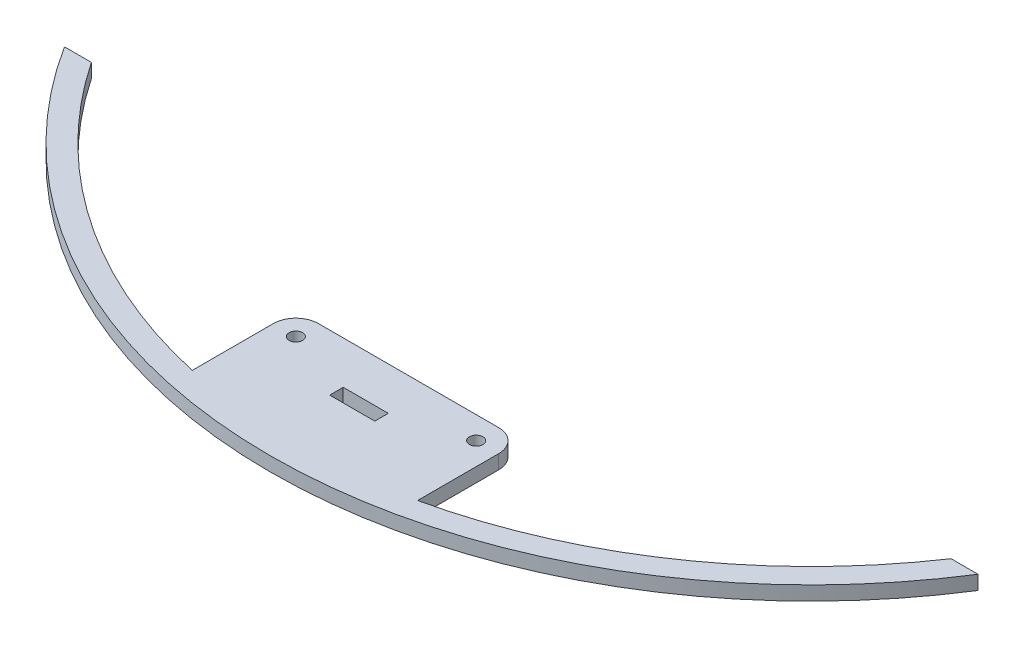
ISO-10303-21;
HEADER;
FILE_DESCRIPTION(('STEP AP214'),'2;1');
FILE_NAME('part.step','',(''),(''),'','','');
FILE_SCHEMA(('AUTOMOTIVE_DESIGN { 1 0 10303 214 1 1 1 1 }'));
ENDSEC;
DATA;
#1=APPLICATION_CONTEXT('core data for automotive mechanical design processes');
#2=APPLICATION_PROTOCOL_DEFINITION('international standard','automotive_design',2000,#1);
#3=PRODUCT_CONTEXT('',#1,'mechanical');
#4=PRODUCT('Part','Part','',(#3));
#5=PRODUCT_RELATED_PRODUCT_CATEGORY('part','',(#4));
#6=PRODUCT_DEFINITION_FORMATION('','',#4);
#7=PRODUCT_DEFINITION_CONTEXT('part definition',#1,'design');
#8=PRODUCT_DEFINITION('design','',#6,#7);
#9=PRODUCT_DEFINITION_SHAPE('','',#8);
#10=(LENGTH_UNIT() NAMED_UNIT(*) SI_UNIT(.MILLI.,.METRE.));
#11=(NAMED_UNIT(*) PLANE_ANGLE_UNIT() SI_UNIT($,.RADIAN.));
#12=(NAMED_UNIT(*) SI_UNIT($,.STERADIAN.) SOLID_ANGLE_UNIT());
#13=UNCERTAINTY_MEASURE_WITH_UNIT(LENGTH_MEASURE(1.E-05),#10,'distance_accuracy_value','');
#14=(GEOMETRIC_REPRESENTATION_CONTEXT(3) GLOBAL_UNCERTAINTY_ASSIGNED_CONTEXT((#13)) GLOBAL_UNIT_ASSIGNED_CONTEXT((#10,
#11,#12)) REPRESENTATION_CONTEXT('',''));
#15=CARTESIAN_POINT('',(0.,0.,0.));
#16=DIRECTION('',(0.,0.,1.));
#17=DIRECTION('',(1.,0.,0.));
#18=AXIS2_PLACEMENT_3D('',#15,#16,#17);
#19=CARTESIAN_POINT('',(0.,3.125,-94.2497216032182));
#20=DIRECTION('',(0.,1.,0.));
#21=DIRECTION('',(0.,0.,1.));
#22=AXIS2_PLACEMENT_3D('',#19,#20,#21);
#23=PLANE('',#22);
#24=CARTESIAN_POINT('',(-20.,3.125,0.));
#25=DIRECTION('',(0.,1.,0.));
#26=DIRECTION('',(0.,0.,1.));
#27=AXIS2_PLACEMENT_3D('',#24,#25,#26);
#28=CIRCLE('',#27,1.5);
#29=CARTESIAN_POINT('',(-20.,3.125,1.5));
#30=VERTEX_POINT('',#29);
#31=EDGE_CURVE('E186',#30,#30,#28,.T.);
#32=ORIENTED_EDGE('',*,*,#31,.F.);
#33=EDGE_LOOP('',(#32));
#34=FACE_BOUND('',#33,.T.);
#35=CARTESIAN_POINT('',(0.,3.125,-94.2497216032182));
#36=DIRECTION('',(0.,-1.,0.));
#37=DIRECTION('',(0.,0.,1.));
#38=AXIS2_PLACEMENT_3D('',#35,#36,#37);
#39=CIRCLE('',#38,115.);
#40=CARTESIAN_POINT('',(-25.,3.125,18.));
#41=VERTEX_POINT('',#40);
#42=CARTESIAN_POINT('',(-95.3780544669944,3.125,-30.));
#43=VERTEX_POINT('',#42);
#44=EDGE_CURVE('E192',#41,#43,#39,.T.);
#45=ORIENTED_EDGE('',*,*,#44,.T.);
#46=DIRECTION('',(-1.,0.,0.));
#47=VECTOR('',#46,1.);
#48=CARTESIAN_POINT('',(-101.350743825139,3.125,-30.));
#49=LINE('',#48,#47);
#50=CARTESIAN_POINT('',(-101.350743825139,3.125,-30.));
#51=VERTEX_POINT('',#50);
#52=EDGE_CURVE('E195',#43,#51,#49,.T.);
#53=ORIENTED_EDGE('',*,*,#52,.T.);
#54=CARTESIAN_POINT('',(0.,3.125,-94.2497216032182));
#55=DIRECTION('',(0.,1.,0.));
#56=DIRECTION('',(0.,0.,1.));
#57=AXIS2_PLACEMENT_3D('',#54,#55,#56);
#58=CIRCLE('',#57,120.);
#59=CARTESIAN_POINT('',(101.350743825139,3.125,-30.));
#60=VERTEX_POINT('',#59);
#61=EDGE_CURVE('E198',#51,#60,#58,.T.);
#62=ORIENTED_EDGE('',*,*,#61,.T.);
#63=DIRECTION('',(-1.,0.,0.));
#64=VECTOR('',#63,1.);
#65=CARTESIAN_POINT('',(95.3780544669944,3.125,-30.));
#66=LINE('',#65,#64);
#67=CARTESIAN_POINT('',(95.3780544669944,3.125,-30.));
#68=VERTEX_POINT('',#67);
#69=EDGE_CURVE('E200',#60,#68,#66,.T.);
#70=ORIENTED_EDGE('',*,*,#69,.T.);
#71=CARTESIAN_POINT('',(0.,3.125,-94.2497216032182));
#72=DIRECTION('',(0.,-1.,0.));
#73=DIRECTION('',(0.,0.,1.));
#74=AXIS2_PLACEMENT_3D('',#71,#72,#73);
#75=CIRCLE('',#74,115.);
#76=CARTESIAN_POINT('',(25.,3.125,18.));
#77=VERTEX_POINT('',#76);
#78=EDGE_CURVE('E202',#68,#77,#75,.T.);
#79=ORIENTED_EDGE('',*,*,#78,.T.);
#80=DIRECTION('',(0.,0.,-1.));
#81=VECTOR('',#80,1.);
#82=CARTESIAN_POINT('',(25.,3.125,0.));
#83=LINE('',#82,#81);
#84=CARTESIAN_POINT('',(25.,3.125,0.));
#85=VERTEX_POINT('',#84);
#86=EDGE_CURVE('E204',#77,#85,#83,.T.);
#87=ORIENTED_EDGE('',*,*,#86,.T.);
#88=CARTESIAN_POINT('',(20.,3.125,0.));
#89=DIRECTION('',(0.,1.,0.));
#90=DIRECTION('',(0.,0.,-1.));
#91=AXIS2_PLACEMENT_3D('',#88,#89,#90);
#92=CIRCLE('',#91,5.);
#93=CARTESIAN_POINT('',(20.,3.125,-5.));
#94=VERTEX_POINT('',#93);
#95=EDGE_CURVE('E206',#85,#94,#92,.T.);
#96=ORIENTED_EDGE('',*,*,#95,.T.);
#97=DIRECTION('',(-1.,0.,0.));
#98=VECTOR('',#97,1.);
#99=CARTESIAN_POINT('',(-20.,3.125,-5.));
#100=LINE('',#99,#98);
#101=CARTESIAN_POINT('',(-20.,3.125,-5.));
#102=VERTEX_POINT('',#101);
#103=EDGE_CURVE('E208',#94,#102,#100,.T.);
#104=ORIENTED_EDGE('',*,*,#103,.T.);
#105=CARTESIAN_POINT('',(-20.,3.125,0.));
#106=DIRECTION('',(0.,1.,0.));
#107=DIRECTION('',(0.,0.,1.));
#108=AXIS2_PLACEMENT_3D('',#105,#106,#107);
#109=CIRCLE('',#108,5.);
#110=CARTESIAN_POINT('',(-25.,3.125,0.));
#111=VERTEX_POINT('',#110);
#112=EDGE_CURVE('E210',#102,#111,#109,.T.);
#113=ORIENTED_EDGE('',*,*,#112,.T.);
#114=DIRECTION('',(0.,0.,1.));
#115=VECTOR('',#114,1.);
#116=CARTESIAN_POINT('',(-25.,3.125,0.));
#117=LINE('',#116,#115);
#118=EDGE_CURVE('E212',#111,#41,#117,.T.);
#119=ORIENTED_EDGE('',*,*,#118,.T.);
#120=EDGE_LOOP('',(#45,#53,#62,#70,#79,#87,#96,#104,#113,#119));
#121=FACE_BOUND('',#120,.T.);
#122=CARTESIAN_POINT('',(20.,3.125,0.));
#123=DIRECTION('',(0.,1.,0.));
#124=DIRECTION('',(0.,0.,-1.));
#125=AXIS2_PLACEMENT_3D('',#122,#123,#124);
#126=CIRCLE('',#125,1.5);
#127=CARTESIAN_POINT('',(20.,3.125,-1.5));
#128=VERTEX_POINT('',#127);
#129=EDGE_CURVE('E180',#128,#128,#126,.T.);
#130=ORIENTED_EDGE('',*,*,#129,.F.);
#131=EDGE_LOOP('',(#130));
#132=FACE_BOUND('',#131,.T.);
#133=DIRECTION('',(-1.,0.,0.));
#134=VECTOR('',#133,1.);
#135=CARTESIAN_POINT('',(-5.,3.125,4.5));
#136=LINE('',#135,#134);
#137=CARTESIAN_POINT('',(5.,3.125,4.5));
#138=VERTEX_POINT('',#137);
#139=CARTESIAN_POINT('',(-5.,3.125,4.5));
#140=VERTEX_POINT('',#139);
#141=EDGE_CURVE('E152',#138,#140,#136,.T.);
#142=ORIENTED_EDGE('',*,*,#141,.F.);
#143=DIRECTION('',(0.,0.,-1.));
#144=VECTOR('',#143,1.);
#145=CARTESIAN_POINT('',(5.,3.125,4.5));
#146=LINE('',#145,#144);
#147=CARTESIAN_POINT('',(5.,3.125,7.5));
#148=VERTEX_POINT('',#147);
#149=EDGE_CURVE('E144',#148,#138,#146,.T.);
#150=ORIENTED_EDGE('',*,*,#149,.F.);
#151=DIRECTION('',(1.,0.,0.));
#152=VECTOR('',#151,1.);
#153=CARTESIAN_POINT('',(-5.,3.125,7.5));
#154=LINE('',#153,#152);
#155=CARTESIAN_POINT('',(-5.,3.125,7.50000000000001));
#156=VERTEX_POINT('',#155);
#157=EDGE_CURVE('E166',#156,#148,#154,.T.);
#158=ORIENTED_EDGE('',*,*,#157,.F.);
#159=DIRECTION('',(0.,0.,1.));
#160=VECTOR('',#159,1.);
#161=CARTESIAN_POINT('',(-5.,3.125,4.5));
#162=LINE('',#161,#160);
#163=EDGE_CURVE('E164',#140,#156,#162,.T.);
#164=ORIENTED_EDGE('',*,*,#163,.F.);
#165=EDGE_LOOP('',(#142,#150,#158,#164));
#166=FACE_BOUND('',#165,.T.);
#167=ADVANCED_FACE('F43',(#34,#121,#132,#166),#23,.T.);
#168=CARTESIAN_POINT('',(0.,0.,-94.2497216032182));
#169=DIRECTION('',(0.,1.,0.));
#170=DIRECTION('',(0.,0.,1.));
#171=AXIS2_PLACEMENT_3D('',#168,#169,#170);
#172=PLANE('',#171);
#173=CARTESIAN_POINT('',(20.,0.,0.));
#174=DIRECTION('',(0.,1.,0.));
#175=DIRECTION('',(0.,0.,-1.));
#176=AXIS2_PLACEMENT_3D('',#173,#174,#175);
#177=CIRCLE('',#176,1.5);
#178=CARTESIAN_POINT('',(20.,0.,-1.5));
#179=VERTEX_POINT('',#178);
#180=EDGE_CURVE('E160',#179,#179,#177,.T.);
#181=ORIENTED_EDGE('',*,*,#180,.T.);
#182=EDGE_LOOP('',(#181));
#183=FACE_BOUND('',#182,.T.);
#184=CARTESIAN_POINT('',(-20.,0.,0.));
#185=DIRECTION('',(0.,1.,0.));
#186=DIRECTION('',(0.,0.,1.));
#187=AXIS2_PLACEMENT_3D('',#184,#185,#186);
#188=CIRCLE('',#187,1.5);
#189=CARTESIAN_POINT('',(-20.,0.,1.5));
#190=VERTEX_POINT('',#189);
#191=EDGE_CURVE('E183',#190,#190,#188,.T.);
#192=ORIENTED_EDGE('',*,*,#191,.T.);
#193=EDGE_LOOP('',(#192));
#194=FACE_BOUND('',#193,.T.);
#195=CARTESIAN_POINT('',(0.,0.,-94.2497216032182));
#196=DIRECTION('',(0.,-1.,0.));
#197=DIRECTION('',(0.,0.,1.));
#198=AXIS2_PLACEMENT_3D('',#195,#196,#197);
#199=CIRCLE('',#198,115.);
#200=CARTESIAN_POINT('',(-25.,0.,18.));
#201=VERTEX_POINT('',#200);
#202=CARTESIAN_POINT('',(-95.3780544669944,0.,-30.));
#203=VERTEX_POINT('',#202);
#204=EDGE_CURVE('E189',#201,#203,#199,.T.);
#205=ORIENTED_EDGE('',*,*,#204,.F.);
#206=DIRECTION('',(0.,0.,1.));
#207=VECTOR('',#206,1.);
#208=CARTESIAN_POINT('',(-25.,0.,0.));
#209=LINE('',#208,#207);
#210=CARTESIAN_POINT('',(-25.,0.,0.));
#211=VERTEX_POINT('',#210);
#212=EDGE_CURVE('E196',#211,#201,#209,.T.);
#213=ORIENTED_EDGE('',*,*,#212,.F.);
#214=CARTESIAN_POINT('',(-20.,0.,0.));
#215=DIRECTION('',(0.,1.,0.));
#216=DIRECTION('',(0.,0.,1.));
#217=AXIS2_PLACEMENT_3D('',#214,#215,#216);
#218=CIRCLE('',#217,5.);
#219=CARTESIAN_POINT('',(-20.,0.,-5.));
#220=VERTEX_POINT('',#219);
#221=EDGE_CURVE('E231',#220,#211,#218,.T.);
#222=ORIENTED_EDGE('',*,*,#221,.F.);
#223=DIRECTION('',(-1.,0.,0.));
#224=VECTOR('',#223,1.);
#225=CARTESIAN_POINT('',(-20.,0.,-5.));
#226=LINE('',#225,#224);
#227=CARTESIAN_POINT('',(20.,0.,-5.));
#228=VERTEX_POINT('',#227);
#229=EDGE_CURVE('E229',#228,#220,#226,.T.);
#230=ORIENTED_EDGE('',*,*,#229,.F.);
#231=CARTESIAN_POINT('',(20.,0.,0.));
#232=DIRECTION('',(0.,1.,0.));
#233=DIRECTION('',(0.,0.,-1.));
#234=AXIS2_PLACEMENT_3D('',#231,#232,#233);
#235=CIRCLE('',#234,5.);
#236=CARTESIAN_POINT('',(25.,0.,0.));
#237=VERTEX_POINT('',#236);
#238=EDGE_CURVE('E227',#237,#228,#235,.T.);
#239=ORIENTED_EDGE('',*,*,#238,.F.);
#240=DIRECTION('',(0.,0.,-1.));
#241=VECTOR('',#240,1.);
#242=CARTESIAN_POINT('',(25.,0.,0.));
#243=LINE('',#242,#241);
#244=CARTESIAN_POINT('',(25.,0.,18.));
#245=VERTEX_POINT('',#244);
#246=EDGE_CURVE('E225',#245,#237,#243,.T.);
#247=ORIENTED_EDGE('',*,*,#246,.F.);
#248=CARTESIAN_POINT('',(0.,0.,-94.2497216032182));
#249=DIRECTION('',(0.,-1.,0.));
#250=DIRECTION('',(0.,0.,1.));
#251=AXIS2_PLACEMENT_3D('',#248,#249,#250);
#252=CIRCLE('',#251,115.);
#253=CARTESIAN_POINT('',(95.3780544669944,0.,-30.));
#254=VERTEX_POINT('',#253);
#255=EDGE_CURVE('E223',#254,#245,#252,.T.);
#256=ORIENTED_EDGE('',*,*,#255,.F.);
#257=DIRECTION('',(-1.,0.,0.));
#258=VECTOR('',#257,1.);
#259=CARTESIAN_POINT('',(95.3780544669944,0.,-30.));
#260=LINE('',#259,#258);
#261=CARTESIAN_POINT('',(101.350743825139,0.,-30.));
#262=VERTEX_POINT('',#261);
#263=EDGE_CURVE('E221',#262,#254,#260,.T.);
#264=ORIENTED_EDGE('',*,*,#263,.F.);
#265=CARTESIAN_POINT('',(0.,0.,-94.2497216032182));
#266=DIRECTION('',(0.,1.,0.));
#267=DIRECTION('',(0.,0.,1.));
#268=AXIS2_PLACEMENT_3D('',#265,#266,#267);
#269=CIRCLE('',#268,120.);
#270=CARTESIAN_POINT('',(-101.350743825139,0.,-30.));
#271=VERTEX_POINT('',#270);
#272=EDGE_CURVE('E219',#271,#262,#269,.T.);
#273=ORIENTED_EDGE('',*,*,#272,.F.);
#274=DIRECTION('',(-1.,0.,0.));
#275=VECTOR('',#274,1.);
#276=CARTESIAN_POINT('',(-101.350743825139,0.,-30.));
#277=LINE('',#276,#275);
#278=EDGE_CURVE('E217',#203,#271,#277,.T.);
#279=ORIENTED_EDGE('',*,*,#278,.F.);
#280=EDGE_LOOP('',(#205,#213,#222,#230,#239,#247,#256,#264,#273,#279));
#281=FACE_BOUND('',#280,.T.);
#282=DIRECTION('',(0.,0.,-1.));
#283=VECTOR('',#282,1.);
#284=CARTESIAN_POINT('',(5.,0.,4.5));
#285=LINE('',#284,#283);
#286=CARTESIAN_POINT('',(5.,0.,7.50000000000001));
#287=VERTEX_POINT('',#286);
#288=CARTESIAN_POINT('',(5.,0.,4.5));
#289=VERTEX_POINT('',#288);
#290=EDGE_CURVE('E66',#287,#289,#285,.T.);
#291=ORIENTED_EDGE('',*,*,#290,.T.);
#292=DIRECTION('',(-1.,0.,0.));
#293=VECTOR('',#292,1.);
#294=CARTESIAN_POINT('',(-5.,0.,4.5));
#295=LINE('',#294,#293);
#296=CARTESIAN_POINT('',(-5.,0.,4.5));
#297=VERTEX_POINT('',#296);
#298=EDGE_CURVE('E159',#289,#297,#295,.T.);
#299=ORIENTED_EDGE('',*,*,#298,.T.);
#300=DIRECTION('',(0.,0.,1.));
#301=VECTOR('',#300,1.);
#302=CARTESIAN_POINT('',(-5.,0.,4.5));
#303=LINE('',#302,#301);
#304=CARTESIAN_POINT('',(-5.,0.,7.5));
#305=VERTEX_POINT('',#304);
#306=EDGE_CURVE('E172',#297,#305,#303,.T.);
#307=ORIENTED_EDGE('',*,*,#306,.T.);
#308=DIRECTION('',(1.,0.,0.));
#309=VECTOR('',#308,1.);
#310=CARTESIAN_POINT('',(-5.,0.,7.5));
#311=LINE('',#310,#309);
#312=EDGE_CURVE('E153',#305,#287,#311,.T.);
#313=ORIENTED_EDGE('',*,*,#312,.T.);
#314=EDGE_LOOP('',(#291,#299,#307,#313));
#315=FACE_BOUND('',#314,.T.);
#316=ADVANCED_FACE('F267',(#183,#194,#281,#315),#172,.F.);
#317=CARTESIAN_POINT('',(0.,3.125,-94.2497216032182));
#318=DIRECTION('',(0.,-1.,0.));
#319=DIRECTION('',(0.,0.,-1.));
#320=AXIS2_PLACEMENT_3D('',#317,#318,#319);
#321=CYLINDRICAL_SURFACE('',#320,115.);
#322=ORIENTED_EDGE('',*,*,#204,.T.);
#323=DIRECTION('',(0.,-1.,0.));
#324=VECTOR('',#323,1.);
#325=CARTESIAN_POINT('',(-95.3780544669944,3.125,-30.));
#326=LINE('',#325,#324);
#327=EDGE_CURVE('E11',#43,#203,#326,.T.);
#328=ORIENTED_EDGE('',*,*,#327,.F.);
#329=ORIENTED_EDGE('',*,*,#44,.F.);
#330=DIRECTION('',(0.,-1.,0.));
#331=VECTOR('',#330,1.);
#332=CARTESIAN_POINT('',(-25.,3.125,18.));
#333=LINE('',#332,#331);
#334=EDGE_CURVE('E214',#41,#201,#333,.T.);
#335=ORIENTED_EDGE('',*,*,#334,.T.);
#336=EDGE_LOOP('',(#322,#328,#329,#335));
#337=FACE_BOUND('',#336,.T.);
#338=ADVANCED_FACE('F45',(#337),#321,.F.);
#339=CARTESIAN_POINT('',(-101.350743825139,3.125,-30.));
#340=DIRECTION('',(0.,0.,1.));
#341=DIRECTION('',(1.,0.,0.));
#342=AXIS2_PLACEMENT_3D('',#339,#340,#341);
#343=PLANE('',#342);
#344=ORIENTED_EDGE('',*,*,#278,.T.);
#345=DIRECTION('',(0.,-1.,0.));
#346=VECTOR('',#345,1.);
#347=CARTESIAN_POINT('',(-101.350743825139,3.125,-30.));
#348=LINE('',#347,#346);
#349=EDGE_CURVE('E51',#51,#271,#348,.T.);
#350=ORIENTED_EDGE('',*,*,#349,.F.);
#351=ORIENTED_EDGE('',*,*,#52,.F.);
#352=ORIENTED_EDGE('',*,*,#327,.T.);
#353=EDGE_LOOP('',(#344,#350,#351,#352));
#354=FACE_BOUND('',#353,.T.);
#355=ADVANCED_FACE('F285',(#354),#343,.F.);
#356=CARTESIAN_POINT('',(0.,3.125,-94.2497216032182));
#357=DIRECTION('',(0.,-1.,0.));
#358=DIRECTION('',(0.,0.,-1.));
#359=AXIS2_PLACEMENT_3D('',#356,#357,#358);
#360=CYLINDRICAL_SURFACE('',#359,120.);
#361=ORIENTED_EDGE('',*,*,#272,.T.);
#362=DIRECTION('',(0.,-1.,0.));
#363=VECTOR('',#362,1.);
#364=CARTESIAN_POINT('',(101.350743825139,3.125,-30.));
#365=LINE('',#364,#363);
#366=EDGE_CURVE('E254',#60,#262,#365,.T.);
#367=ORIENTED_EDGE('',*,*,#366,.F.);
#368=ORIENTED_EDGE('',*,*,#61,.F.);
#369=ORIENTED_EDGE('',*,*,#349,.T.);
#370=EDGE_LOOP('',(#361,#367,#368,#369));
#371=FACE_BOUND('',#370,.T.);
#372=ADVANCED_FACE('F261',(#371),#360,.T.);
#373=CARTESIAN_POINT('',(95.3780544669944,3.125,-30.));
#374=DIRECTION('',(0.,0.,1.));
#375=DIRECTION('',(1.,0.,0.));
#376=AXIS2_PLACEMENT_3D('',#373,#374,#375);
#377=PLANE('',#376);
#378=ORIENTED_EDGE('',*,*,#263,.T.);
#379=DIRECTION('',(0.,-1.,0.));
#380=VECTOR('',#379,1.);
#381=CARTESIAN_POINT('',(95.3780544669944,3.125,-30.));
#382=LINE('',#381,#380);
#383=EDGE_CURVE('E251',#68,#254,#382,.T.);
#384=ORIENTED_EDGE('',*,*,#383,.F.);
#385=ORIENTED_EDGE('',*,*,#69,.F.);
#386=ORIENTED_EDGE('',*,*,#366,.T.);
#387=EDGE_LOOP('',(#378,#384,#385,#386));
#388=FACE_BOUND('',#387,.T.);
#389=ADVANCED_FACE('F273',(#388),#377,.F.);
#390=CARTESIAN_POINT('',(0.,3.125,-94.2497216032182));
#391=DIRECTION('',(0.,-1.,0.));
#392=DIRECTION('',(0.,0.,-1.));
#393=AXIS2_PLACEMENT_3D('',#390,#391,#392);
#394=CYLINDRICAL_SURFACE('',#393,115.);
#395=ORIENTED_EDGE('',*,*,#255,.T.);
#396=DIRECTION('',(0.,-1.,0.));
#397=VECTOR('',#396,1.);
#398=CARTESIAN_POINT('',(25.,3.125,18.));
#399=LINE('',#398,#397);
#400=EDGE_CURVE('E248',#77,#245,#399,.T.);
#401=ORIENTED_EDGE('',*,*,#400,.F.);
#402=ORIENTED_EDGE('',*,*,#78,.F.);
#403=ORIENTED_EDGE('',*,*,#383,.T.);
#404=EDGE_LOOP('',(#395,#401,#402,#403));
#405=FACE_BOUND('',#404,.T.);
#406=ADVANCED_FACE('F277',(#405),#394,.F.);
#407=CARTESIAN_POINT('',(25.,3.125,0.));
#408=DIRECTION('',(-1.,0.,0.));
#409=DIRECTION('',(0.,0.,1.));
#410=AXIS2_PLACEMENT_3D('',#407,#408,#409);
#411=PLANE('',#410);
#412=ORIENTED_EDGE('',*,*,#246,.T.);
#413=DIRECTION('',(0.,-1.,0.));
#414=VECTOR('',#413,1.);
#415=CARTESIAN_POINT('',(25.,3.125,0.));
#416=LINE('',#415,#414);
#417=EDGE_CURVE('E245',#85,#237,#416,.T.);
#418=ORIENTED_EDGE('',*,*,#417,.F.);
#419=ORIENTED_EDGE('',*,*,#86,.F.);
#420=ORIENTED_EDGE('',*,*,#400,.T.);
#421=EDGE_LOOP('',(#412,#418,#419,#420));
#422=FACE_BOUND('',#421,.T.);
#423=ADVANCED_FACE('F308',(#422),#411,.F.);
#424=CARTESIAN_POINT('',(20.,3.125,0.));
#425=DIRECTION('',(0.,-1.,0.));
#426=DIRECTION('',(0.,0.,-1.));
#427=AXIS2_PLACEMENT_3D('',#424,#425,#426);
#428=CYLINDRICAL_SURFACE('',#427,5.);
#429=ORIENTED_EDGE('',*,*,#238,.T.);
#430=DIRECTION('',(0.,-1.,0.));
#431=VECTOR('',#430,1.);
#432=CARTESIAN_POINT('',(20.,3.125,-5.));
#433=LINE('',#432,#431);
#434=EDGE_CURVE('E242',#94,#228,#433,.T.);
#435=ORIENTED_EDGE('',*,*,#434,.F.);
#436=ORIENTED_EDGE('',*,*,#95,.F.);
#437=ORIENTED_EDGE('',*,*,#417,.T.);
#438=EDGE_LOOP('',(#429,#435,#436,#437));
#439=FACE_BOUND('',#438,.T.);
#440=ADVANCED_FACE('F305',(#439),#428,.T.);
#441=CARTESIAN_POINT('',(-20.,3.125,-5.));
#442=DIRECTION('',(0.,0.,1.));
#443=DIRECTION('',(1.,0.,0.));
#444=AXIS2_PLACEMENT_3D('',#441,#442,#443);
#445=PLANE('',#444);
#446=ORIENTED_EDGE('',*,*,#229,.T.);
#447=DIRECTION('',(0.,-1.,0.));
#448=VECTOR('',#447,1.);
#449=CARTESIAN_POINT('',(-20.,3.125,-5.));
#450=LINE('',#449,#448);
#451=EDGE_CURVE('E239',#102,#220,#450,.T.);
#452=ORIENTED_EDGE('',*,*,#451,.F.);
#453=ORIENTED_EDGE('',*,*,#103,.F.);
#454=ORIENTED_EDGE('',*,*,#434,.T.);
#455=EDGE_LOOP('',(#446,#452,#453,#454));
#456=FACE_BOUND('',#455,.T.);
#457=ADVANCED_FACE('F301',(#456),#445,.F.);
#458=CARTESIAN_POINT('',(-20.,3.125,0.));
#459=DIRECTION('',(0.,-1.,0.));
#460=DIRECTION('',(0.,0.,-1.));
#461=AXIS2_PLACEMENT_3D('',#458,#459,#460);
#462=CYLINDRICAL_SURFACE('',#461,5.);
#463=ORIENTED_EDGE('',*,*,#221,.T.);
#464=DIRECTION('',(0.,-1.,0.));
#465=VECTOR('',#464,1.);
#466=CARTESIAN_POINT('',(-25.,3.125,0.));
#467=LINE('',#466,#465);
#468=EDGE_CURVE('E236',#111,#211,#467,.T.);
#469=ORIENTED_EDGE('',*,*,#468,.F.);
#470=ORIENTED_EDGE('',*,*,#112,.F.);
#471=ORIENTED_EDGE('',*,*,#451,.T.);
#472=EDGE_LOOP('',(#463,#469,#470,#471));
#473=FACE_BOUND('',#472,.T.);
#474=ADVANCED_FACE('F297',(#473),#462,.T.);
#475=CARTESIAN_POINT('',(-25.,3.125,0.));
#476=DIRECTION('',(1.,0.,0.));
#477=DIRECTION('',(0.,0.,-1.));
#478=AXIS2_PLACEMENT_3D('',#475,#476,#477);
#479=PLANE('',#478);
#480=ORIENTED_EDGE('',*,*,#212,.T.);
#481=ORIENTED_EDGE('',*,*,#334,.F.);
#482=ORIENTED_EDGE('',*,*,#118,.F.);
#483=ORIENTED_EDGE('',*,*,#468,.T.);
#484=EDGE_LOOP('',(#480,#481,#482,#483));
#485=FACE_BOUND('',#484,.T.);
#486=ADVANCED_FACE('F292',(#485),#479,.F.);
#487=CARTESIAN_POINT('',(-20.,3.125,0.));
#488=DIRECTION('',(0.,-1.,0.));
#489=DIRECTION('',(0.,0.,-1.));
#490=AXIS2_PLACEMENT_3D('',#487,#488,#489);
#491=CYLINDRICAL_SURFACE('',#490,1.5);
#492=ORIENTED_EDGE('',*,*,#31,.T.);
#493=EDGE_LOOP('',(#492));
#494=FACE_BOUND('',#493,.T.);
#495=ORIENTED_EDGE('',*,*,#191,.F.);
#496=EDGE_LOOP('',(#495));
#497=FACE_BOUND('',#496,.T.);
#498=ADVANCED_FACE('F327',(#494,#497),#491,.F.);
#499=CARTESIAN_POINT('',(20.,3.125,0.));
#500=DIRECTION('',(0.,-1.,0.));
#501=DIRECTION('',(0.,0.,-1.));
#502=AXIS2_PLACEMENT_3D('',#499,#500,#501);
#503=CYLINDRICAL_SURFACE('',#502,1.5);
#504=ORIENTED_EDGE('',*,*,#129,.T.);
#505=EDGE_LOOP('',(#504));
#506=FACE_BOUND('',#505,.T.);
#507=ORIENTED_EDGE('',*,*,#180,.F.);
#508=EDGE_LOOP('',(#507));
#509=FACE_BOUND('',#508,.T.);
#510=ADVANCED_FACE('F356',(#506,#509),#503,.F.);
#511=CARTESIAN_POINT('',(5.,3.125,4.5));
#512=DIRECTION('',(-1.,0.,0.));
#513=DIRECTION('',(0.,0.,1.));
#514=AXIS2_PLACEMENT_3D('',#511,#512,#513);
#515=PLANE('',#514);
#516=ORIENTED_EDGE('',*,*,#290,.F.);
#517=DIRECTION('',(0.,-1.,0.));
#518=VECTOR('',#517,1.);
#519=CARTESIAN_POINT('',(5.,3.125,7.5));
#520=LINE('',#519,#518);
#521=EDGE_CURVE('E148',#148,#287,#520,.T.);
#522=ORIENTED_EDGE('',*,*,#521,.F.);
#523=ORIENTED_EDGE('',*,*,#149,.T.);
#524=DIRECTION('',(0.,-1.,0.));
#525=VECTOR('',#524,1.);
#526=CARTESIAN_POINT('',(5.,3.125,4.5));
#527=LINE('',#526,#525);
#528=EDGE_CURVE('E147',#138,#289,#527,.T.);
#529=ORIENTED_EDGE('',*,*,#528,.T.);
#530=EDGE_LOOP('',(#516,#522,#523,#529));
#531=FACE_BOUND('',#530,.T.);
#532=ADVANCED_FACE('F146',(#531),#515,.T.);
#533=CARTESIAN_POINT('',(-5.,3.125,4.5));
#534=DIRECTION('',(0.,0.,1.));
#535=DIRECTION('',(1.,0.,0.));
#536=AXIS2_PLACEMENT_3D('',#533,#534,#535);
#537=PLANE('',#536);
#538=ORIENTED_EDGE('',*,*,#298,.F.);
#539=ORIENTED_EDGE('',*,*,#528,.F.);
#540=ORIENTED_EDGE('',*,*,#141,.T.);
#541=DIRECTION('',(0.,-1.,0.));
#542=VECTOR('',#541,1.);
#543=CARTESIAN_POINT('',(-5.,3.125,4.5));
#544=LINE('',#543,#542);
#545=EDGE_CURVE('E161',#140,#297,#544,.T.);
#546=ORIENTED_EDGE('',*,*,#545,.T.);
#547=EDGE_LOOP('',(#538,#539,#540,#546));
#548=FACE_BOUND('',#547,.T.);
#549=ADVANCED_FACE('F156',(#548),#537,.T.);
#550=CARTESIAN_POINT('',(-5.,3.125,4.5));
#551=DIRECTION('',(1.,0.,0.));
#552=DIRECTION('',(0.,0.,-1.));
#553=AXIS2_PLACEMENT_3D('',#550,#551,#552);
#554=PLANE('',#553);
#555=ORIENTED_EDGE('',*,*,#306,.F.);
#556=ORIENTED_EDGE('',*,*,#545,.F.);
#557=ORIENTED_EDGE('',*,*,#163,.T.);
#558=DIRECTION('',(0.,-1.,0.));
#559=VECTOR('',#558,1.);
#560=CARTESIAN_POINT('',(-5.,3.125,7.5));
#561=LINE('',#560,#559);
#562=EDGE_CURVE('E58',#156,#305,#561,.T.);
#563=ORIENTED_EDGE('',*,*,#562,.T.);
#564=EDGE_LOOP('',(#555,#556,#557,#563));
#565=FACE_BOUND('',#564,.T.);
#566=ADVANCED_FACE('F378',(#565),#554,.T.);
#567=CARTESIAN_POINT('',(-5.,3.125,7.5));
#568=DIRECTION('',(0.,0.,-1.));
#569=DIRECTION('',(-1.,0.,0.));
#570=AXIS2_PLACEMENT_3D('',#567,#568,#569);
#571=PLANE('',#570);
#572=ORIENTED_EDGE('',*,*,#312,.F.);
#573=ORIENTED_EDGE('',*,*,#562,.F.);
#574=ORIENTED_EDGE('',*,*,#157,.T.);
#575=ORIENTED_EDGE('',*,*,#521,.T.);
#576=EDGE_LOOP('',(#572,#573,#574,#575));
#577=FACE_BOUND('',#576,.T.);
#578=ADVANCED_FACE('F386',(#577),#571,.T.);
#579=CLOSED_SHELL('',(#167,#316,#338,#355,#372,#389,#406,#423,#440,#457,#474,#486,#498,#510,
#532,#549,#566,#578));
#580=MANIFOLD_SOLID_BREP('B2',#579);
#581=ADVANCED_BREP_SHAPE_REPRESENTATION('',(#18,#580),#14);
#582=SHAPE_DEFINITION_REPRESENTATION(#9,#581);
ENDSEC;
END-ISO-10303-21;
